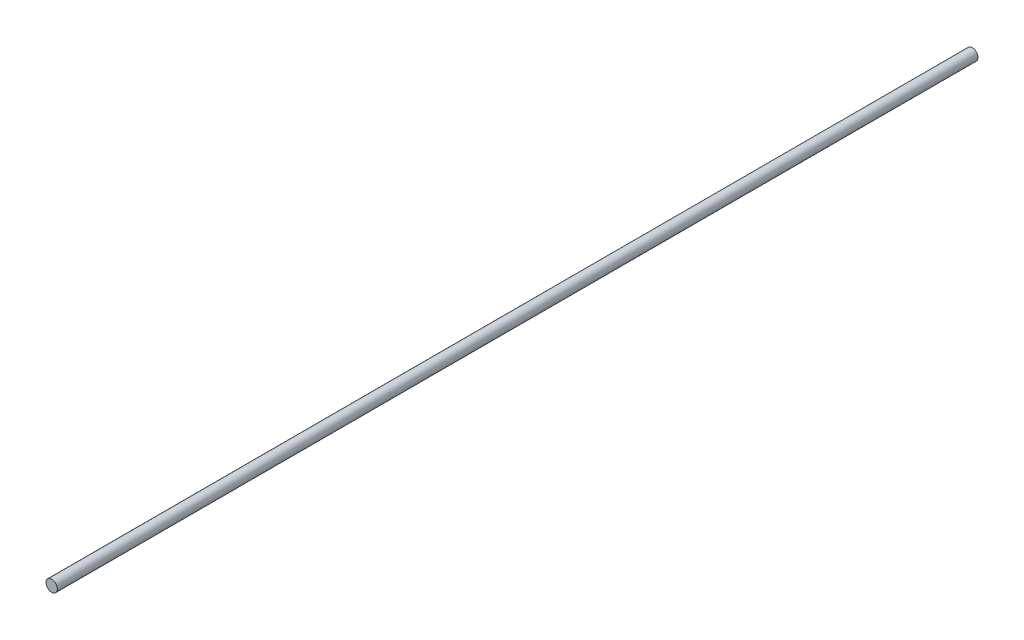
ISO-10303-21;
HEADER;
FILE_DESCRIPTION(('STEP AP214'),'2;1');
FILE_NAME('part.step','',(''),(''),'','','');
FILE_SCHEMA(('AUTOMOTIVE_DESIGN { 1 0 10303 214 1 1 1 1 }'));
ENDSEC;
DATA;
#1=APPLICATION_CONTEXT('core data for automotive mechanical design processes');
#2=APPLICATION_PROTOCOL_DEFINITION('international standard','automotive_design',2000,#1);
#3=PRODUCT_CONTEXT('',#1,'mechanical');
#4=PRODUCT('Part','Part','',(#3));
#5=PRODUCT_RELATED_PRODUCT_CATEGORY('part','',(#4));
#6=PRODUCT_DEFINITION_FORMATION('','',#4);
#7=PRODUCT_DEFINITION_CONTEXT('part definition',#1,'design');
#8=PRODUCT_DEFINITION('design','',#6,#7);
#9=PRODUCT_DEFINITION_SHAPE('','',#8);
#10=(LENGTH_UNIT() NAMED_UNIT(*) SI_UNIT(.MILLI.,.METRE.));
#11=(NAMED_UNIT(*) PLANE_ANGLE_UNIT() SI_UNIT($,.RADIAN.));
#12=(NAMED_UNIT(*) SI_UNIT($,.STERADIAN.) SOLID_ANGLE_UNIT());
#13=UNCERTAINTY_MEASURE_WITH_UNIT(LENGTH_MEASURE(1.E-05),#10,'distance_accuracy_value','');
#14=(GEOMETRIC_REPRESENTATION_CONTEXT(3) GLOBAL_UNCERTAINTY_ASSIGNED_CONTEXT((#13)) GLOBAL_UNIT_ASSIGNED_CONTEXT((#10,
#11,#12)) REPRESENTATION_CONTEXT('',''));
#15=CARTESIAN_POINT('',(0.,0.,0.));
#16=DIRECTION('',(0.,0.,1.));
#17=DIRECTION('',(1.,0.,0.));
#18=AXIS2_PLACEMENT_3D('',#15,#16,#17);
#19=CARTESIAN_POINT('',(0.,0.,648.));
#20=DIRECTION('',(0.,0.,-1.));
#21=DIRECTION('',(-1.,0.,0.));
#22=AXIS2_PLACEMENT_3D('',#19,#20,#21);
#23=CYLINDRICAL_SURFACE('',#22,4.);
#24=CARTESIAN_POINT('',(0.,0.,648.));
#25=DIRECTION('',(0.,0.,1.));
#26=DIRECTION('',(1.,0.,0.));
#27=AXIS2_PLACEMENT_3D('',#24,#25,#26);
#28=CIRCLE('',#27,4.);
#29=CARTESIAN_POINT('',(4.,0.,648.));
#30=VERTEX_POINT('',#29);
#31=EDGE_CURVE('E10',#30,#30,#28,.T.);
#32=ORIENTED_EDGE('',*,*,#31,.F.);
#33=EDGE_LOOP('',(#32));
#34=FACE_BOUND('',#33,.T.);
#35=CARTESIAN_POINT('',(0.,0.,0.));
#36=DIRECTION('',(0.,0.,1.));
#37=DIRECTION('',(1.,0.,0.));
#38=AXIS2_PLACEMENT_3D('',#35,#36,#37);
#39=CIRCLE('',#38,4.);
#40=CARTESIAN_POINT('',(4.,0.,0.));
#41=VERTEX_POINT('',#40);
#42=EDGE_CURVE('E34',#41,#41,#39,.T.);
#43=ORIENTED_EDGE('',*,*,#42,.T.);
#44=EDGE_LOOP('',(#43));
#45=FACE_BOUND('',#44,.T.);
#46=ADVANCED_FACE('F31',(#34,#45),#23,.T.);
#47=CARTESIAN_POINT('',(0.,0.,648.));
#48=DIRECTION('',(0.,0.,1.));
#49=DIRECTION('',(1.,0.,0.));
#50=AXIS2_PLACEMENT_3D('',#47,#48,#49);
#51=PLANE('',#50);
#52=ORIENTED_EDGE('',*,*,#31,.T.);
#53=EDGE_LOOP('',(#52));
#54=FACE_BOUND('',#53,.T.);
#55=ADVANCED_FACE('F46',(#54),#51,.T.);
#56=CARTESIAN_POINT('',(0.,0.,0.));
#57=DIRECTION('',(0.,0.,1.));
#58=DIRECTION('',(1.,0.,0.));
#59=AXIS2_PLACEMENT_3D('',#56,#57,#58);
#60=PLANE('',#59);
#61=ORIENTED_EDGE('',*,*,#42,.F.);
#62=EDGE_LOOP('',(#61));
#63=FACE_BOUND('',#62,.T.);
#64=ADVANCED_FACE('F44',(#63),#60,.F.);
#65=CLOSED_SHELL('',(#46,#55,#64));
#66=MANIFOLD_SOLID_BREP('B2',#65);
#67=ADVANCED_BREP_SHAPE_REPRESENTATION('',(#18,#66),#14);
#68=SHAPE_DEFINITION_REPRESENTATION(#9,#67);
ENDSEC;
END-ISO-10303-21;
